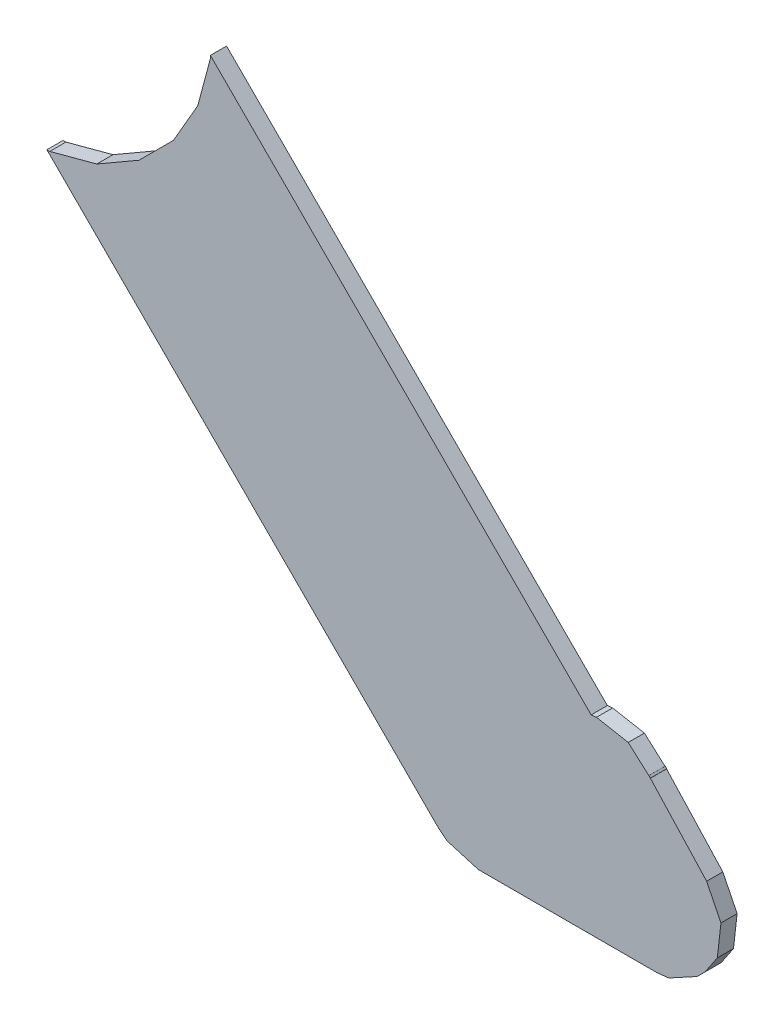
ISO-10303-21;
HEADER;
FILE_DESCRIPTION(('STEP AP214'),'2;1');
FILE_NAME('part.step','',(''),(''),'','','');
FILE_SCHEMA(('AUTOMOTIVE_DESIGN { 1 0 10303 214 1 1 1 1 }'));
ENDSEC;
DATA;
#1=APPLICATION_CONTEXT('core data for automotive mechanical design processes');
#2=APPLICATION_PROTOCOL_DEFINITION('international standard','automotive_design',2000,#1);
#3=PRODUCT_CONTEXT('',#1,'mechanical');
#4=PRODUCT('Part','Part','',(#3));
#5=PRODUCT_RELATED_PRODUCT_CATEGORY('part','',(#4));
#6=PRODUCT_DEFINITION_FORMATION('','',#4);
#7=PRODUCT_DEFINITION_CONTEXT('part definition',#1,'design');
#8=PRODUCT_DEFINITION('design','',#6,#7);
#9=PRODUCT_DEFINITION_SHAPE('','',#8);
#10=(LENGTH_UNIT() NAMED_UNIT(*) SI_UNIT(.MILLI.,.METRE.));
#11=(NAMED_UNIT(*) PLANE_ANGLE_UNIT() SI_UNIT($,.RADIAN.));
#12=(NAMED_UNIT(*) SI_UNIT($,.STERADIAN.) SOLID_ANGLE_UNIT());
#13=UNCERTAINTY_MEASURE_WITH_UNIT(LENGTH_MEASURE(1.E-05),#10,'distance_accuracy_value','');
#14=(GEOMETRIC_REPRESENTATION_CONTEXT(3) GLOBAL_UNCERTAINTY_ASSIGNED_CONTEXT((#13)) GLOBAL_UNIT_ASSIGNED_CONTEXT((#10,
#11,#12)) REPRESENTATION_CONTEXT('',''));
#15=CARTESIAN_POINT('',(0.,0.,0.));
#16=DIRECTION('',(0.,0.,1.));
#17=DIRECTION('',(1.,0.,0.));
#18=AXIS2_PLACEMENT_3D('',#15,#16,#17);
#19=CARTESIAN_POINT('',(0.,0.,0.));
#20=DIRECTION('',(0.,0.,1.));
#21=DIRECTION('',(1.,0.,0.));
#22=AXIS2_PLACEMENT_3D('',#19,#20,#21);
#23=PLANE('',#22);
#24=DIRECTION('',(0.707106781186548,-0.707106781186548,0.));
#25=VECTOR('',#24,1.);
#26=CARTESIAN_POINT('',(141.624,-73.198446,0.));
#27=LINE('',#26,#25);
#28=CARTESIAN_POINT('',(141.624,-73.198446,0.));
#29=VERTEX_POINT('',#28);
#30=CARTESIAN_POINT('',(142.447435,-74.021881,0.));
#31=VERTEX_POINT('',#30);
#32=EDGE_CURVE('E20',#29,#31,#27,.T.);
#33=ORIENTED_EDGE('',*,*,#32,.F.);
#34=DIRECTION('',(0.,1.,0.));
#35=VECTOR('',#34,1.);
#36=CARTESIAN_POINT('',(141.624,-73.204661,0.));
#37=LINE('',#36,#35);
#38=CARTESIAN_POINT('',(141.624,-73.204661,0.));
#39=VERTEX_POINT('',#38);
#40=EDGE_CURVE('E242',#39,#29,#37,.T.);
#41=ORIENTED_EDGE('',*,*,#40,.F.);
#42=DIRECTION('',(0.258816607244931,0.965926479507743,0.));
#43=VECTOR('',#42,1.);
#44=CARTESIAN_POINT('',(141.596741,-73.306394,0.));
#45=LINE('',#44,#43);
#46=CARTESIAN_POINT('',(141.596741,-73.306394,0.));
#47=VERTEX_POINT('',#46);
#48=EDGE_CURVE('E245',#47,#39,#45,.T.);
#49=ORIENTED_EDGE('',*,*,#48,.F.);
#50=DIRECTION('',(0.499998057724796,0.866026525154647,0.));
#51=VECTOR('',#50,1.);
#52=CARTESIAN_POINT('',(141.54408,-73.397606,0.));
#53=LINE('',#52,#51);
#54=CARTESIAN_POINT('',(141.54408,-73.397606,0.));
#55=VERTEX_POINT('',#54);
#56=EDGE_CURVE('E304',#55,#47,#53,.T.);
#57=ORIENTED_EDGE('',*,*,#56,.F.);
#58=DIRECTION('',(0.707106781186548,0.707106781186548,0.));
#59=VECTOR('',#58,1.);
#60=CARTESIAN_POINT('',(141.469606,-73.47208,0.));
#61=LINE('',#60,#59);
#62=CARTESIAN_POINT('',(141.469606,-73.47208,0.));
#63=VERTEX_POINT('',#62);
#64=EDGE_CURVE('E322',#63,#55,#61,.T.);
#65=ORIENTED_EDGE('',*,*,#64,.F.);
#66=DIRECTION('',(0.866026525154647,0.499998057724796,0.));
#67=VECTOR('',#66,1.);
#68=CARTESIAN_POINT('',(141.378394,-73.524741,0.));
#69=LINE('',#68,#67);
#70=CARTESIAN_POINT('',(141.378394,-73.524741,0.));
#71=VERTEX_POINT('',#70);
#72=EDGE_CURVE('E341',#71,#63,#69,.T.);
#73=ORIENTED_EDGE('',*,*,#72,.F.);
#74=DIRECTION('',(0.965926479507743,0.258816607244931,0.));
#75=VECTOR('',#74,1.);
#76=CARTESIAN_POINT('',(141.276661,-73.552,0.));
#77=LINE('',#76,#75);
#78=CARTESIAN_POINT('',(141.276661,-73.552,0.));
#79=VERTEX_POINT('',#78);
#80=EDGE_CURVE('E277',#79,#71,#77,.T.);
#81=ORIENTED_EDGE('',*,*,#80,.F.);
#82=DIRECTION('',(1.,0.,0.));
#83=VECTOR('',#82,1.);
#84=CARTESIAN_POINT('',(141.270446,-73.552,0.));
#85=LINE('',#84,#83);
#86=CARTESIAN_POINT('',(141.270446,-73.552,0.));
#87=VERTEX_POINT('',#86);
#88=EDGE_CURVE('E326',#87,#79,#85,.T.);
#89=ORIENTED_EDGE('',*,*,#88,.F.);
#90=DIRECTION('',(-0.707107199502924,0.707106362869924,0.));
#91=VECTOR('',#90,1.);
#92=CARTESIAN_POINT('',(142.115628,-74.397181,0.));
#93=LINE('',#92,#91);
#94=CARTESIAN_POINT('',(142.115628,-74.397181,0.));
#95=VERTEX_POINT('',#94);
#96=EDGE_CURVE('E309',#95,#87,#93,.T.);
#97=ORIENTED_EDGE('',*,*,#96,.F.);
#98=DIRECTION('',(-0.778648447168256,0.627460433591206,0.));
#99=VECTOR('',#98,1.);
#100=CARTESIAN_POINT('',(142.13627,-74.413815,0.));
#101=LINE('',#100,#99);
#102=CARTESIAN_POINT('',(142.13627,-74.413815,0.));
#103=VERTEX_POINT('',#102);
#104=EDGE_CURVE('E294',#103,#95,#101,.T.);
#105=ORIENTED_EDGE('',*,*,#104,.F.);
#106=DIRECTION('',(-0.959490754592873,0.281740114024963,0.));
#107=VECTOR('',#106,1.);
#108=CARTESIAN_POINT('',(142.203309,-74.4335,0.));
#109=LINE('',#108,#107);
#110=CARTESIAN_POINT('',(142.203309,-74.4335,0.));
#111=VERTEX_POINT('',#110);
#112=EDGE_CURVE('E288',#111,#103,#109,.T.);
#113=ORIENTED_EDGE('',*,*,#112,.F.);
#114=DIRECTION('',(-1.,0.,0.));
#115=VECTOR('',#114,1.);
#116=CARTESIAN_POINT('',(142.588969,-74.4335,0.));
#117=LINE('',#116,#115);
#118=CARTESIAN_POINT('',(142.588969,-74.4335,0.));
#119=VERTEX_POINT('',#118);
#120=EDGE_CURVE('E283',#119,#111,#117,.T.);
#121=ORIENTED_EDGE('',*,*,#120,.F.);
#122=DIRECTION('',(-0.994267127979957,-0.106924638032995,0.));
#123=VECTOR('',#122,1.);
#124=CARTESIAN_POINT('',(142.615331,-74.430665,0.));
#125=LINE('',#124,#123);
#126=CARTESIAN_POINT('',(142.615331,-74.430665,0.));
#127=VERTEX_POINT('',#126);
#128=EDGE_CURVE('E400',#127,#119,#125,.T.);
#129=ORIENTED_EDGE('',*,*,#128,.F.);
#130=DIRECTION('',(-0.877669027841351,-0.479267229808192,0.));
#131=VECTOR('',#130,1.);
#132=CARTESIAN_POINT('',(142.676653,-74.397179,0.));
#133=LINE('',#132,#131);
#134=CARTESIAN_POINT('',(142.676653,-74.397179,0.));
#135=VERTEX_POINT('',#134);
#136=EDGE_CURVE('E514',#135,#127,#133,.T.);
#137=ORIENTED_EDGE('',*,*,#136,.F.);
#138=DIRECTION('',(-0.707085922887417,-0.707127638870417,0.));
#139=VECTOR('',#138,1.);
#140=CARTESIAN_POINT('',(142.693603,-74.380228,0.));
#141=LINE('',#140,#139);
#142=CARTESIAN_POINT('',(142.693603,-74.380228,0.));
#143=VERTEX_POINT('',#142);
#144=EDGE_CURVE('E472',#143,#135,#141,.T.);
#145=ORIENTED_EDGE('',*,*,#144,.F.);
#146=DIRECTION('',(-0.557899251719927,-0.829908684693892,0.));
#147=VECTOR('',#146,1.);
#148=CARTESIAN_POINT('',(142.720211,-74.340647,0.));
#149=LINE('',#148,#147);
#150=CARTESIAN_POINT('',(142.720211,-74.340647,0.));
#151=VERTEX_POINT('',#150);
#152=EDGE_CURVE('E493',#151,#143,#149,.T.);
#153=ORIENTED_EDGE('',*,*,#152,.F.);
#154=DIRECTION('',(-0.112495414351994,-0.99365224387095,0.));
#155=VECTOR('',#154,1.);
#156=CARTESIAN_POINT('',(142.728071,-74.271221,0.));
#157=LINE('',#156,#155);
#158=CARTESIAN_POINT('',(142.728071,-74.271221,0.));
#159=VERTEX_POINT('',#158);
#160=EDGE_CURVE('E440',#159,#151,#157,.T.);
#161=ORIENTED_EDGE('',*,*,#160,.F.);
#162=DIRECTION('',(0.442564663002036,-0.896736594024073,0.));
#163=VECTOR('',#162,1.);
#164=CARTESIAN_POINT('',(142.697149,-74.208566,0.));
#165=LINE('',#164,#163);
#166=CARTESIAN_POINT('',(142.697149,-74.208566,0.));
#167=VERTEX_POINT('',#166);
#168=EDGE_CURVE('E394',#167,#159,#165,.T.);
#169=ORIENTED_EDGE('',*,*,#168,.F.);
#170=DIRECTION('',(0.677282903208041,-0.735722684863045,0.));
#171=VECTOR('',#170,1.);
#172=CARTESIAN_POINT('',(142.575831,-74.07678,0.));
#173=LINE('',#172,#171);
#174=CARTESIAN_POINT('',(142.575831,-74.07678,0.));
#175=VERTEX_POINT('',#174);
#176=EDGE_CURVE('E457',#175,#167,#173,.T.);
#177=ORIENTED_EDGE('',*,*,#176,.F.);
#178=DIRECTION('',(0.5462677805389,-0.837610596843846,0.));
#179=VECTOR('',#178,1.);
#180=CARTESIAN_POINT('',(142.575456,-74.076205,0.));
#181=LINE('',#180,#179);
#182=CARTESIAN_POINT('',(142.575456,-74.076205,0.));
#183=VERTEX_POINT('',#182);
#184=EDGE_CURVE('E445',#183,#175,#181,.T.);
#185=ORIENTED_EDGE('',*,*,#184,.F.);
#186=DIRECTION('',(0.745159422245727,-0.666886373708756,0.));
#187=VECTOR('',#186,1.);
#188=CARTESIAN_POINT('',(142.575218,-74.075992,0.));
#189=LINE('',#188,#187);
#190=CARTESIAN_POINT('',(142.575218,-74.075992,0.));
#191=VERTEX_POINT('',#190);
#192=EDGE_CURVE('E422',#191,#183,#189,.T.);
#193=ORIENTED_EDGE('',*,*,#192,.F.);
#194=DIRECTION('',(0.61420896246173,-0.789143428301653,0.));
#195=VECTOR('',#194,1.);
#196=CARTESIAN_POINT('',(142.572683,-74.072735,0.));
#197=LINE('',#196,#195);
#198=CARTESIAN_POINT('',(142.572683,-74.072735,0.));
#199=VERTEX_POINT('',#198);
#200=EDGE_CURVE('E378',#199,#191,#197,.T.);
#201=ORIENTED_EDGE('',*,*,#200,.F.);
#202=DIRECTION('',(0.789783766543973,0.613385361826979,0.));
#203=VECTOR('',#202,1.);
#204=CARTESIAN_POINT('',(142.572092,-74.073194,0.));
#205=LINE('',#204,#203);
#206=CARTESIAN_POINT('',(142.572092,-74.073194,0.));
#207=VERTEX_POINT('',#206);
#208=EDGE_CURVE('E388',#207,#199,#205,.T.);
#209=ORIENTED_EDGE('',*,*,#208,.F.);
#210=DIRECTION('',(0.745231243913527,-0.666806113570577,0.));
#211=VECTOR('',#210,1.);
#212=CARTESIAN_POINT('',(142.527573,-74.03336,0.));
#213=LINE('',#212,#211);
#214=CARTESIAN_POINT('',(142.527573,-74.03336,0.));
#215=VERTEX_POINT('',#214);
#216=EDGE_CURVE('E363',#215,#207,#213,.T.);
#217=ORIENTED_EDGE('',*,*,#216,.F.);
#218=DIRECTION('',(0.98343956374106,-0.181236377333011,0.));
#219=VECTOR('',#218,1.);
#220=CARTESIAN_POINT('',(142.45886,-74.020697,0.));
#221=LINE('',#220,#219);
#222=CARTESIAN_POINT('',(142.45886,-74.020697,0.));
#223=VERTEX_POINT('',#222);
#224=EDGE_CURVE('E365',#223,#215,#221,.T.);
#225=ORIENTED_EDGE('',*,*,#224,.F.);
#226=DIRECTION('',(0.994673033582067,0.103080338885007,0.));
#227=VECTOR('',#226,1.);
#228=CARTESIAN_POINT('',(142.447435,-74.021881,0.));
#229=LINE('',#228,#227);
#230=EDGE_CURVE('E656',#31,#223,#229,.T.);
#231=ORIENTED_EDGE('',*,*,#230,.F.);
#232=EDGE_LOOP('',(#33,#41,#49,#57,#65,#73,#81,#89,#97,#105,#113,#121,#129,#137,#145,#153,#161,
#169,#177,#185,#193,#201,#209,#217,#225,#231));
#233=FACE_BOUND('',#232,.T.);
#234=ADVANCED_FACE('F17',(#233),#23,.T.);
#235=CARTESIAN_POINT('',(0.,0.,-0.035));
#236=DIRECTION('',(0.,0.,1.));
#237=DIRECTION('',(1.,0.,0.));
#238=AXIS2_PLACEMENT_3D('',#235,#236,#237);
#239=PLANE('',#238);
#240=DIRECTION('',(0.994673033582067,0.103080338885007,0.));
#241=VECTOR('',#240,1.);
#242=CARTESIAN_POINT('',(142.447435,-74.021881,-0.035));
#243=LINE('',#242,#241);
#244=CARTESIAN_POINT('',(142.447435,-74.021881,-0.035));
#245=VERTEX_POINT('',#244);
#246=CARTESIAN_POINT('',(142.45886,-74.020697,-0.035));
#247=VERTEX_POINT('',#246);
#248=EDGE_CURVE('E370',#245,#247,#243,.T.);
#249=ORIENTED_EDGE('',*,*,#248,.T.);
#250=DIRECTION('',(0.98343956374106,-0.181236377333011,0.));
#251=VECTOR('',#250,1.);
#252=CARTESIAN_POINT('',(142.45886,-74.020697,-0.035));
#253=LINE('',#252,#251);
#254=CARTESIAN_POINT('',(142.527573,-74.03336,-0.035));
#255=VERTEX_POINT('',#254);
#256=EDGE_CURVE('E377',#247,#255,#253,.T.);
#257=ORIENTED_EDGE('',*,*,#256,.T.);
#258=DIRECTION('',(0.745231243913527,-0.666806113570577,0.));
#259=VECTOR('',#258,1.);
#260=CARTESIAN_POINT('',(142.527573,-74.03336,-0.035));
#261=LINE('',#260,#259);
#262=CARTESIAN_POINT('',(142.572092,-74.073194,-0.035));
#263=VERTEX_POINT('',#262);
#264=EDGE_CURVE('E384',#255,#263,#261,.T.);
#265=ORIENTED_EDGE('',*,*,#264,.T.);
#266=DIRECTION('',(0.789783766543973,0.613385361826979,0.));
#267=VECTOR('',#266,1.);
#268=CARTESIAN_POINT('',(142.572092,-74.073194,-0.035));
#269=LINE('',#268,#267);
#270=CARTESIAN_POINT('',(142.572683,-74.072735,-0.035));
#271=VERTEX_POINT('',#270);
#272=EDGE_CURVE('E383',#263,#271,#269,.T.);
#273=ORIENTED_EDGE('',*,*,#272,.T.);
#274=DIRECTION('',(0.61420896246173,-0.789143428301653,0.));
#275=VECTOR('',#274,1.);
#276=CARTESIAN_POINT('',(142.572683,-74.072735,-0.035));
#277=LINE('',#276,#275);
#278=CARTESIAN_POINT('',(142.575218,-74.075992,-0.035));
#279=VERTEX_POINT('',#278);
#280=EDGE_CURVE('E418',#271,#279,#277,.T.);
#281=ORIENTED_EDGE('',*,*,#280,.T.);
#282=DIRECTION('',(0.745159422245727,-0.666886373708756,0.));
#283=VECTOR('',#282,1.);
#284=CARTESIAN_POINT('',(142.575218,-74.075992,-0.035));
#285=LINE('',#284,#283);
#286=CARTESIAN_POINT('',(142.575456,-74.076205,-0.035));
#287=VERTEX_POINT('',#286);
#288=EDGE_CURVE('E433',#279,#287,#285,.T.);
#289=ORIENTED_EDGE('',*,*,#288,.T.);
#290=DIRECTION('',(0.5462677805389,-0.837610596843846,0.));
#291=VECTOR('',#290,1.);
#292=CARTESIAN_POINT('',(142.575456,-74.076205,-0.035));
#293=LINE('',#292,#291);
#294=CARTESIAN_POINT('',(142.575831,-74.07678,-0.035));
#295=VERTEX_POINT('',#294);
#296=EDGE_CURVE('E453',#287,#295,#293,.T.);
#297=ORIENTED_EDGE('',*,*,#296,.T.);
#298=DIRECTION('',(0.677282903208041,-0.735722684863045,0.));
#299=VECTOR('',#298,1.);
#300=CARTESIAN_POINT('',(142.575831,-74.07678,-0.035));
#301=LINE('',#300,#299);
#302=CARTESIAN_POINT('',(142.697149,-74.208566,-0.035));
#303=VERTEX_POINT('',#302);
#304=EDGE_CURVE('E390',#295,#303,#301,.T.);
#305=ORIENTED_EDGE('',*,*,#304,.T.);
#306=DIRECTION('',(0.442564663002036,-0.896736594024073,0.));
#307=VECTOR('',#306,1.);
#308=CARTESIAN_POINT('',(142.697149,-74.208566,-0.035));
#309=LINE('',#308,#307);
#310=CARTESIAN_POINT('',(142.728071,-74.271221,-0.035));
#311=VERTEX_POINT('',#310);
#312=EDGE_CURVE('E436',#303,#311,#309,.T.);
#313=ORIENTED_EDGE('',*,*,#312,.T.);
#314=DIRECTION('',(-0.112495414351994,-0.99365224387095,0.));
#315=VECTOR('',#314,1.);
#316=CARTESIAN_POINT('',(142.728071,-74.271221,-0.035));
#317=LINE('',#316,#315);
#318=CARTESIAN_POINT('',(142.720211,-74.340647,-0.035));
#319=VERTEX_POINT('',#318);
#320=EDGE_CURVE('E489',#311,#319,#317,.T.);
#321=ORIENTED_EDGE('',*,*,#320,.T.);
#322=DIRECTION('',(-0.557899251719927,-0.829908684693892,0.));
#323=VECTOR('',#322,1.);
#324=CARTESIAN_POINT('',(142.720211,-74.340647,-0.035));
#325=LINE('',#324,#323);
#326=CARTESIAN_POINT('',(142.693603,-74.380228,-0.035));
#327=VERTEX_POINT('',#326);
#328=EDGE_CURVE('E501',#319,#327,#325,.T.);
#329=ORIENTED_EDGE('',*,*,#328,.T.);
#330=DIRECTION('',(-0.707085922887417,-0.707127638870417,0.));
#331=VECTOR('',#330,1.);
#332=CARTESIAN_POINT('',(142.693603,-74.380228,-0.035));
#333=LINE('',#332,#331);
#334=CARTESIAN_POINT('',(142.676653,-74.397179,-0.035));
#335=VERTEX_POINT('',#334);
#336=EDGE_CURVE('E471',#327,#335,#333,.T.);
#337=ORIENTED_EDGE('',*,*,#336,.T.);
#338=DIRECTION('',(-0.877669027841351,-0.479267229808192,0.));
#339=VECTOR('',#338,1.);
#340=CARTESIAN_POINT('',(142.676653,-74.397179,-0.035));
#341=LINE('',#340,#339);
#342=CARTESIAN_POINT('',(142.615331,-74.430665,-0.035));
#343=VERTEX_POINT('',#342);
#344=EDGE_CURVE('E405',#335,#343,#341,.T.);
#345=ORIENTED_EDGE('',*,*,#344,.T.);
#346=DIRECTION('',(-0.994267127979957,-0.106924638032995,0.));
#347=VECTOR('',#346,1.);
#348=CARTESIAN_POINT('',(142.615331,-74.430665,-0.035));
#349=LINE('',#348,#347);
#350=CARTESIAN_POINT('',(142.588969,-74.4335,-0.035));
#351=VERTEX_POINT('',#350);
#352=EDGE_CURVE('E275',#343,#351,#349,.T.);
#353=ORIENTED_EDGE('',*,*,#352,.T.);
#354=DIRECTION('',(-1.,0.,0.));
#355=VECTOR('',#354,1.);
#356=CARTESIAN_POINT('',(142.588969,-74.4335,-0.035));
#357=LINE('',#356,#355);
#358=CARTESIAN_POINT('',(142.203309,-74.4335,-0.035));
#359=VERTEX_POINT('',#358);
#360=EDGE_CURVE('E293',#351,#359,#357,.T.);
#361=ORIENTED_EDGE('',*,*,#360,.T.);
#362=DIRECTION('',(-0.959490754592873,0.281740114024963,0.));
#363=VECTOR('',#362,1.);
#364=CARTESIAN_POINT('',(142.203309,-74.4335,-0.035));
#365=LINE('',#364,#363);
#366=CARTESIAN_POINT('',(142.13627,-74.413815,-0.035));
#367=VERTEX_POINT('',#366);
#368=EDGE_CURVE('E299',#359,#367,#365,.T.);
#369=ORIENTED_EDGE('',*,*,#368,.T.);
#370=DIRECTION('',(-0.778648447168256,0.627460433591206,0.));
#371=VECTOR('',#370,1.);
#372=CARTESIAN_POINT('',(142.13627,-74.413815,-0.035));
#373=LINE('',#372,#371);
#374=CARTESIAN_POINT('',(142.115628,-74.397181,-0.035));
#375=VERTEX_POINT('',#374);
#376=EDGE_CURVE('E306',#367,#375,#373,.T.);
#377=ORIENTED_EDGE('',*,*,#376,.T.);
#378=DIRECTION('',(-0.707107199502924,0.707106362869924,0.));
#379=VECTOR('',#378,1.);
#380=CARTESIAN_POINT('',(142.115628,-74.397181,-0.035));
#381=LINE('',#380,#379);
#382=CARTESIAN_POINT('',(141.270446,-73.552,-0.035));
#383=VERTEX_POINT('',#382);
#384=EDGE_CURVE('E318',#375,#383,#381,.T.);
#385=ORIENTED_EDGE('',*,*,#384,.T.);
#386=DIRECTION('',(1.,0.,0.));
#387=VECTOR('',#386,1.);
#388=CARTESIAN_POINT('',(141.270446,-73.552,-0.035));
#389=LINE('',#388,#387);
#390=CARTESIAN_POINT('',(141.276661,-73.552,-0.035));
#391=VERTEX_POINT('',#390);
#392=EDGE_CURVE('E282',#383,#391,#389,.T.);
#393=ORIENTED_EDGE('',*,*,#392,.T.);
#394=DIRECTION('',(0.965926479507743,0.258816607244931,0.));
#395=VECTOR('',#394,1.);
#396=CARTESIAN_POINT('',(141.276661,-73.552,-0.035));
#397=LINE('',#396,#395);
#398=CARTESIAN_POINT('',(141.378394,-73.524741,-0.035));
#399=VERTEX_POINT('',#398);
#400=EDGE_CURVE('E337',#391,#399,#397,.T.);
#401=ORIENTED_EDGE('',*,*,#400,.T.);
#402=DIRECTION('',(0.866026525154647,0.499998057724796,0.));
#403=VECTOR('',#402,1.);
#404=CARTESIAN_POINT('',(141.378394,-73.524741,-0.035));
#405=LINE('',#404,#403);
#406=CARTESIAN_POINT('',(141.469606,-73.47208,-0.035));
#407=VERTEX_POINT('',#406);
#408=EDGE_CURVE('E342',#399,#407,#405,.T.);
#409=ORIENTED_EDGE('',*,*,#408,.T.);
#410=DIRECTION('',(0.707106781186548,0.707106781186548,0.));
#411=VECTOR('',#410,1.);
#412=CARTESIAN_POINT('',(141.469606,-73.47208,-0.035));
#413=LINE('',#412,#411);
#414=CARTESIAN_POINT('',(141.54408,-73.397606,-0.035));
#415=VERTEX_POINT('',#414);
#416=EDGE_CURVE('E300',#407,#415,#413,.T.);
#417=ORIENTED_EDGE('',*,*,#416,.T.);
#418=DIRECTION('',(0.499998057724796,0.866026525154647,0.));
#419=VECTOR('',#418,1.);
#420=CARTESIAN_POINT('',(141.54408,-73.397606,-0.035));
#421=LINE('',#420,#419);
#422=CARTESIAN_POINT('',(141.596741,-73.306394,-0.035));
#423=VERTEX_POINT('',#422);
#424=EDGE_CURVE('E265',#415,#423,#421,.T.);
#425=ORIENTED_EDGE('',*,*,#424,.T.);
#426=DIRECTION('',(0.258816607244931,0.965926479507743,0.));
#427=VECTOR('',#426,1.);
#428=CARTESIAN_POINT('',(141.596741,-73.306394,-0.035));
#429=LINE('',#428,#427);
#430=CARTESIAN_POINT('',(141.624,-73.204661,-0.035));
#431=VERTEX_POINT('',#430);
#432=EDGE_CURVE('E251',#423,#431,#429,.T.);
#433=ORIENTED_EDGE('',*,*,#432,.T.);
#434=DIRECTION('',(0.,1.,0.));
#435=VECTOR('',#434,1.);
#436=CARTESIAN_POINT('',(141.624,-73.204661,-0.035));
#437=LINE('',#436,#435);
#438=CARTESIAN_POINT('',(141.624,-73.198446,-0.035));
#439=VERTEX_POINT('',#438);
#440=EDGE_CURVE('E256',#431,#439,#437,.T.);
#441=ORIENTED_EDGE('',*,*,#440,.T.);
#442=DIRECTION('',(0.707106781186548,-0.707106781186548,0.));
#443=VECTOR('',#442,1.);
#444=CARTESIAN_POINT('',(141.624,-73.198446,-0.035));
#445=LINE('',#444,#443);
#446=EDGE_CURVE('E11',#439,#245,#445,.T.);
#447=ORIENTED_EDGE('',*,*,#446,.T.);
#448=EDGE_LOOP('',(#249,#257,#265,#273,#281,#289,#297,#305,#313,#321,#329,#337,#345,#353,#361,
#369,#377,#385,#393,#401,#409,#417,#425,#433,#441,#447));
#449=FACE_BOUND('',#448,.T.);
#450=ADVANCED_FACE('F531',(#449),#239,.F.);
#451=CARTESIAN_POINT('',(141.624,-73.198446,-0.035));
#452=DIRECTION('',(0.707106781186548,0.707106781186548,0.));
#453=DIRECTION('',(0.,0.,-1.));
#454=AXIS2_PLACEMENT_3D('',#451,#452,#453);
#455=PLANE('',#454);
#456=DIRECTION('',(0.,0.,1.));
#457=VECTOR('',#456,1.);
#458=CARTESIAN_POINT('',(141.624,-73.198446,-0.035));
#459=LINE('',#458,#457);
#460=EDGE_CURVE('E250',#439,#29,#459,.T.);
#461=ORIENTED_EDGE('',*,*,#460,.T.);
#462=ORIENTED_EDGE('',*,*,#32,.T.);
#463=DIRECTION('',(0.,0.,1.));
#464=VECTOR('',#463,1.);
#465=CARTESIAN_POINT('',(142.447435,-74.021881,-0.035));
#466=LINE('',#465,#464);
#467=EDGE_CURVE('E674',#245,#31,#466,.T.);
#468=ORIENTED_EDGE('',*,*,#467,.F.);
#469=ORIENTED_EDGE('',*,*,#446,.F.);
#470=EDGE_LOOP('',(#461,#462,#468,#469));
#471=FACE_BOUND('',#470,.T.);
#472=ADVANCED_FACE('F718',(#471),#455,.T.);
#473=CARTESIAN_POINT('',(141.624,-73.204661,-0.035));
#474=DIRECTION('',(-1.,0.,0.));
#475=DIRECTION('',(0.,0.,1.));
#476=AXIS2_PLACEMENT_3D('',#473,#474,#475);
#477=PLANE('',#476);
#478=DIRECTION('',(0.,0.,1.));
#479=VECTOR('',#478,1.);
#480=CARTESIAN_POINT('',(141.624,-73.204661,-0.035));
#481=LINE('',#480,#479);
#482=EDGE_CURVE('E254',#431,#39,#481,.T.);
#483=ORIENTED_EDGE('',*,*,#482,.T.);
#484=ORIENTED_EDGE('',*,*,#40,.T.);
#485=ORIENTED_EDGE('',*,*,#460,.F.);
#486=ORIENTED_EDGE('',*,*,#440,.F.);
#487=EDGE_LOOP('',(#483,#484,#485,#486));
#488=FACE_BOUND('',#487,.T.);
#489=ADVANCED_FACE('F255',(#488),#477,.T.);
#490=CARTESIAN_POINT('',(141.596741,-73.306394,-0.035));
#491=DIRECTION('',(-0.965926479507743,0.258816607244931,0.));
#492=DIRECTION('',(0.,0.,1.));
#493=AXIS2_PLACEMENT_3D('',#490,#491,#492);
#494=PLANE('',#493);
#495=DIRECTION('',(0.,0.,1.));
#496=VECTOR('',#495,1.);
#497=CARTESIAN_POINT('',(141.596741,-73.306394,-0.035));
#498=LINE('',#497,#496);
#499=EDGE_CURVE('E262',#423,#47,#498,.T.);
#500=ORIENTED_EDGE('',*,*,#499,.T.);
#501=ORIENTED_EDGE('',*,*,#48,.T.);
#502=ORIENTED_EDGE('',*,*,#482,.F.);
#503=ORIENTED_EDGE('',*,*,#432,.F.);
#504=EDGE_LOOP('',(#500,#501,#502,#503));
#505=FACE_BOUND('',#504,.T.);
#506=ADVANCED_FACE('F260',(#505),#494,.T.);
#507=CARTESIAN_POINT('',(141.54408,-73.397606,-0.035));
#508=DIRECTION('',(-0.866026525154647,0.499998057724796,0.));
#509=DIRECTION('',(0.,0.,1.));
#510=AXIS2_PLACEMENT_3D('',#507,#508,#509);
#511=PLANE('',#510);
#512=DIRECTION('',(0.,0.,1.));
#513=VECTOR('',#512,1.);
#514=CARTESIAN_POINT('',(141.54408,-73.397606,-0.035));
#515=LINE('',#514,#513);
#516=EDGE_CURVE('E305',#415,#55,#515,.T.);
#517=ORIENTED_EDGE('',*,*,#516,.T.);
#518=ORIENTED_EDGE('',*,*,#56,.T.);
#519=ORIENTED_EDGE('',*,*,#499,.F.);
#520=ORIENTED_EDGE('',*,*,#424,.F.);
#521=EDGE_LOOP('',(#517,#518,#519,#520));
#522=FACE_BOUND('',#521,.T.);
#523=ADVANCED_FACE('F739',(#522),#511,.T.);
#524=CARTESIAN_POINT('',(141.469606,-73.47208,-0.035));
#525=DIRECTION('',(-0.707106781186548,0.707106781186548,0.));
#526=DIRECTION('',(0.,0.,1.));
#527=AXIS2_PLACEMENT_3D('',#524,#525,#526);
#528=PLANE('',#527);
#529=DIRECTION('',(0.,0.,1.));
#530=VECTOR('',#529,1.);
#531=CARTESIAN_POINT('',(141.469606,-73.47208,-0.035));
#532=LINE('',#531,#530);
#533=EDGE_CURVE('E346',#407,#63,#532,.T.);
#534=ORIENTED_EDGE('',*,*,#533,.T.);
#535=ORIENTED_EDGE('',*,*,#64,.T.);
#536=ORIENTED_EDGE('',*,*,#516,.F.);
#537=ORIENTED_EDGE('',*,*,#416,.F.);
#538=EDGE_LOOP('',(#534,#535,#536,#537));
#539=FACE_BOUND('',#538,.T.);
#540=ADVANCED_FACE('F747',(#539),#528,.T.);
#541=CARTESIAN_POINT('',(141.378394,-73.524741,-0.035));
#542=DIRECTION('',(-0.499998057724796,0.866026525154647,0.));
#543=DIRECTION('',(0.,0.,1.));
#544=AXIS2_PLACEMENT_3D('',#541,#542,#543);
#545=PLANE('',#544);
#546=DIRECTION('',(0.,0.,1.));
#547=VECTOR('',#546,1.);
#548=CARTESIAN_POINT('',(141.378394,-73.524741,-0.035));
#549=LINE('',#548,#547);
#550=EDGE_CURVE('E281',#399,#71,#549,.T.);
#551=ORIENTED_EDGE('',*,*,#550,.T.);
#552=ORIENTED_EDGE('',*,*,#72,.T.);
#553=ORIENTED_EDGE('',*,*,#533,.F.);
#554=ORIENTED_EDGE('',*,*,#408,.F.);
#555=EDGE_LOOP('',(#551,#552,#553,#554));
#556=FACE_BOUND('',#555,.T.);
#557=ADVANCED_FACE('F755',(#556),#545,.T.);
#558=CARTESIAN_POINT('',(141.276661,-73.552,-0.035));
#559=DIRECTION('',(-0.258816607244931,0.965926479507743,0.));
#560=DIRECTION('',(0.,0.,1.));
#561=AXIS2_PLACEMENT_3D('',#558,#559,#560);
#562=PLANE('',#561);
#563=DIRECTION('',(0.,0.,1.));
#564=VECTOR('',#563,1.);
#565=CARTESIAN_POINT('',(141.276661,-73.552,-0.035));
#566=LINE('',#565,#564);
#567=EDGE_CURVE('E330',#391,#79,#566,.T.);
#568=ORIENTED_EDGE('',*,*,#567,.T.);
#569=ORIENTED_EDGE('',*,*,#80,.T.);
#570=ORIENTED_EDGE('',*,*,#550,.F.);
#571=ORIENTED_EDGE('',*,*,#400,.F.);
#572=EDGE_LOOP('',(#568,#569,#570,#571));
#573=FACE_BOUND('',#572,.T.);
#574=ADVANCED_FACE('F764',(#573),#562,.T.);
#575=CARTESIAN_POINT('',(141.270446,-73.552,-0.035));
#576=DIRECTION('',(0.,1.,0.));
#577=DIRECTION('',(1.,0.,0.));
#578=AXIS2_PLACEMENT_3D('',#575,#576,#577);
#579=PLANE('',#578);
#580=DIRECTION('',(0.,0.,1.));
#581=VECTOR('',#580,1.);
#582=CARTESIAN_POINT('',(141.270446,-73.552,-0.035));
#583=LINE('',#582,#581);
#584=EDGE_CURVE('E314',#383,#87,#583,.T.);
#585=ORIENTED_EDGE('',*,*,#584,.T.);
#586=ORIENTED_EDGE('',*,*,#88,.T.);
#587=ORIENTED_EDGE('',*,*,#567,.F.);
#588=ORIENTED_EDGE('',*,*,#392,.F.);
#589=EDGE_LOOP('',(#585,#586,#587,#588));
#590=FACE_BOUND('',#589,.T.);
#591=ADVANCED_FACE('F773',(#590),#579,.T.);
#592=CARTESIAN_POINT('',(142.115628,-74.397181,-0.035));
#593=DIRECTION('',(-0.707106362869924,-0.707107199502924,0.));
#594=DIRECTION('',(-0.707107199502924,0.707106362869924,0.));
#595=AXIS2_PLACEMENT_3D('',#592,#593,#594);
#596=PLANE('',#595);
#597=DIRECTION('',(0.,0.,1.));
#598=VECTOR('',#597,1.);
#599=CARTESIAN_POINT('',(142.115628,-74.397181,-0.035));
#600=LINE('',#599,#598);
#601=EDGE_CURVE('E298',#375,#95,#600,.T.);
#602=ORIENTED_EDGE('',*,*,#601,.T.);
#603=ORIENTED_EDGE('',*,*,#96,.T.);
#604=ORIENTED_EDGE('',*,*,#584,.F.);
#605=ORIENTED_EDGE('',*,*,#384,.F.);
#606=EDGE_LOOP('',(#602,#603,#604,#605));
#607=FACE_BOUND('',#606,.T.);
#608=ADVANCED_FACE('F782',(#607),#596,.T.);
#609=CARTESIAN_POINT('',(142.13627,-74.413815,-0.035));
#610=DIRECTION('',(-0.627460433591206,-0.778648447168256,0.));
#611=DIRECTION('',(-0.778648447168256,0.627460433591206,0.));
#612=AXIS2_PLACEMENT_3D('',#609,#610,#611);
#613=PLANE('',#612);
#614=DIRECTION('',(0.,0.,1.));
#615=VECTOR('',#614,1.);
#616=CARTESIAN_POINT('',(142.13627,-74.413815,-0.035));
#617=LINE('',#616,#615);
#618=EDGE_CURVE('E292',#367,#103,#617,.T.);
#619=ORIENTED_EDGE('',*,*,#618,.T.);
#620=ORIENTED_EDGE('',*,*,#104,.T.);
#621=ORIENTED_EDGE('',*,*,#601,.F.);
#622=ORIENTED_EDGE('',*,*,#376,.F.);
#623=EDGE_LOOP('',(#619,#620,#621,#622));
#624=FACE_BOUND('',#623,.T.);
#625=ADVANCED_FACE('F791',(#624),#613,.T.);
#626=CARTESIAN_POINT('',(142.203309,-74.4335,-0.035));
#627=DIRECTION('',(-0.281740114024963,-0.959490754592873,0.));
#628=DIRECTION('',(-0.959490754592873,0.281740114024963,0.));
#629=AXIS2_PLACEMENT_3D('',#626,#627,#628);
#630=PLANE('',#629);
#631=DIRECTION('',(0.,0.,1.));
#632=VECTOR('',#631,1.);
#633=CARTESIAN_POINT('',(142.203309,-74.4335,-0.035));
#634=LINE('',#633,#632);
#635=EDGE_CURVE('E287',#359,#111,#634,.T.);
#636=ORIENTED_EDGE('',*,*,#635,.T.);
#637=ORIENTED_EDGE('',*,*,#112,.T.);
#638=ORIENTED_EDGE('',*,*,#618,.F.);
#639=ORIENTED_EDGE('',*,*,#368,.F.);
#640=EDGE_LOOP('',(#636,#637,#638,#639));
#641=FACE_BOUND('',#640,.T.);
#642=ADVANCED_FACE('F800',(#641),#630,.T.);
#643=CARTESIAN_POINT('',(142.588969,-74.4335,-0.035));
#644=DIRECTION('',(0.,-1.,0.));
#645=DIRECTION('',(0.,0.,-1.));
#646=AXIS2_PLACEMENT_3D('',#643,#644,#645);
#647=PLANE('',#646);
#648=DIRECTION('',(0.,0.,1.));
#649=VECTOR('',#648,1.);
#650=CARTESIAN_POINT('',(142.588969,-74.4335,-0.035));
#651=LINE('',#650,#649);
#652=EDGE_CURVE('E404',#351,#119,#651,.T.);
#653=ORIENTED_EDGE('',*,*,#652,.T.);
#654=ORIENTED_EDGE('',*,*,#120,.T.);
#655=ORIENTED_EDGE('',*,*,#635,.F.);
#656=ORIENTED_EDGE('',*,*,#360,.F.);
#657=EDGE_LOOP('',(#653,#654,#655,#656));
#658=FACE_BOUND('',#657,.T.);
#659=ADVANCED_FACE('F806',(#658),#647,.T.);
#660=CARTESIAN_POINT('',(142.615331,-74.430665,-0.035));
#661=DIRECTION('',(0.106924638032995,-0.994267127979957,0.));
#662=DIRECTION('',(0.,0.,-1.));
#663=AXIS2_PLACEMENT_3D('',#660,#661,#662);
#664=PLANE('',#663);
#665=DIRECTION('',(0.,0.,1.));
#666=VECTOR('',#665,1.);
#667=CARTESIAN_POINT('',(142.615331,-74.430665,-0.035));
#668=LINE('',#667,#666);
#669=EDGE_CURVE('E518',#343,#127,#668,.T.);
#670=ORIENTED_EDGE('',*,*,#669,.T.);
#671=ORIENTED_EDGE('',*,*,#128,.T.);
#672=ORIENTED_EDGE('',*,*,#652,.F.);
#673=ORIENTED_EDGE('',*,*,#352,.F.);
#674=EDGE_LOOP('',(#670,#671,#672,#673));
#675=FACE_BOUND('',#674,.T.);
#676=ADVANCED_FACE('F537',(#675),#664,.T.);
#677=CARTESIAN_POINT('',(142.676653,-74.397179,-0.035));
#678=DIRECTION('',(0.479267229808192,-0.877669027841351,0.));
#679=DIRECTION('',(0.,0.,-1.));
#680=AXIS2_PLACEMENT_3D('',#677,#678,#679);
#681=PLANE('',#680);
#682=DIRECTION('',(0.,0.,1.));
#683=VECTOR('',#682,1.);
#684=CARTESIAN_POINT('',(142.676653,-74.397179,-0.035));
#685=LINE('',#684,#683);
#686=EDGE_CURVE('E467',#335,#135,#685,.T.);
#687=ORIENTED_EDGE('',*,*,#686,.T.);
#688=ORIENTED_EDGE('',*,*,#136,.T.);
#689=ORIENTED_EDGE('',*,*,#669,.F.);
#690=ORIENTED_EDGE('',*,*,#344,.F.);
#691=EDGE_LOOP('',(#687,#688,#689,#690));
#692=FACE_BOUND('',#691,.T.);
#693=ADVANCED_FACE('F535',(#692),#681,.T.);
#694=CARTESIAN_POINT('',(142.693603,-74.380228,-0.035));
#695=DIRECTION('',(0.707127638870417,-0.707085922887417,0.));
#696=DIRECTION('',(0.,0.,-1.));
#697=AXIS2_PLACEMENT_3D('',#694,#695,#696);
#698=PLANE('',#697);
#699=DIRECTION('',(0.,0.,1.));
#700=VECTOR('',#699,1.);
#701=CARTESIAN_POINT('',(142.693603,-74.380228,-0.035));
#702=LINE('',#701,#700);
#703=EDGE_CURVE('E497',#327,#143,#702,.T.);
#704=ORIENTED_EDGE('',*,*,#703,.T.);
#705=ORIENTED_EDGE('',*,*,#144,.T.);
#706=ORIENTED_EDGE('',*,*,#686,.F.);
#707=ORIENTED_EDGE('',*,*,#336,.F.);
#708=EDGE_LOOP('',(#704,#705,#706,#707));
#709=FACE_BOUND('',#708,.T.);
#710=ADVANCED_FACE('F827',(#709),#698,.T.);
#711=CARTESIAN_POINT('',(142.720211,-74.340647,-0.035));
#712=DIRECTION('',(0.829908684693892,-0.557899251719927,0.));
#713=DIRECTION('',(0.,0.,-1.));
#714=AXIS2_PLACEMENT_3D('',#711,#712,#713);
#715=PLANE('',#714);
#716=DIRECTION('',(0.,0.,1.));
#717=VECTOR('',#716,1.);
#718=CARTESIAN_POINT('',(142.720211,-74.340647,-0.035));
#719=LINE('',#718,#717);
#720=EDGE_CURVE('E485',#319,#151,#719,.T.);
#721=ORIENTED_EDGE('',*,*,#720,.T.);
#722=ORIENTED_EDGE('',*,*,#152,.T.);
#723=ORIENTED_EDGE('',*,*,#703,.F.);
#724=ORIENTED_EDGE('',*,*,#328,.F.);
#725=EDGE_LOOP('',(#721,#722,#723,#724));
#726=FACE_BOUND('',#725,.T.);
#727=ADVANCED_FACE('F835',(#726),#715,.T.);
#728=CARTESIAN_POINT('',(142.728071,-74.271221,-0.035));
#729=DIRECTION('',(0.99365224387095,-0.112495414351994,0.));
#730=DIRECTION('',(0.,0.,-1.));
#731=AXIS2_PLACEMENT_3D('',#728,#729,#730);
#732=PLANE('',#731);
#733=DIRECTION('',(0.,0.,1.));
#734=VECTOR('',#733,1.);
#735=CARTESIAN_POINT('',(142.728071,-74.271221,-0.035));
#736=LINE('',#735,#734);
#737=EDGE_CURVE('E441',#311,#159,#736,.T.);
#738=ORIENTED_EDGE('',*,*,#737,.T.);
#739=ORIENTED_EDGE('',*,*,#160,.T.);
#740=ORIENTED_EDGE('',*,*,#720,.F.);
#741=ORIENTED_EDGE('',*,*,#320,.F.);
#742=EDGE_LOOP('',(#738,#739,#740,#741));
#743=FACE_BOUND('',#742,.T.);
#744=ADVANCED_FACE('F860',(#743),#732,.T.);
#745=CARTESIAN_POINT('',(142.697149,-74.208566,-0.035));
#746=DIRECTION('',(0.896736594024073,0.442564663002036,0.));
#747=DIRECTION('',(0.,0.,-1.));
#748=AXIS2_PLACEMENT_3D('',#745,#746,#747);
#749=PLANE('',#748);
#750=DIRECTION('',(0.,0.,1.));
#751=VECTOR('',#750,1.);
#752=CARTESIAN_POINT('',(142.697149,-74.208566,-0.035));
#753=LINE('',#752,#751);
#754=EDGE_CURVE('E395',#303,#167,#753,.T.);
#755=ORIENTED_EDGE('',*,*,#754,.T.);
#756=ORIENTED_EDGE('',*,*,#168,.T.);
#757=ORIENTED_EDGE('',*,*,#737,.F.);
#758=ORIENTED_EDGE('',*,*,#312,.F.);
#759=EDGE_LOOP('',(#755,#756,#757,#758));
#760=FACE_BOUND('',#759,.T.);
#761=ADVANCED_FACE('F847',(#760),#749,.T.);
#762=CARTESIAN_POINT('',(142.575831,-74.07678,-0.035));
#763=DIRECTION('',(0.735722684863045,0.677282903208041,0.));
#764=DIRECTION('',(0.,0.,-1.));
#765=AXIS2_PLACEMENT_3D('',#762,#763,#764);
#766=PLANE('',#765);
#767=DIRECTION('',(0.,0.,1.));
#768=VECTOR('',#767,1.);
#769=CARTESIAN_POINT('',(142.575831,-74.07678,-0.035));
#770=LINE('',#769,#768);
#771=EDGE_CURVE('E449',#295,#175,#770,.T.);
#772=ORIENTED_EDGE('',*,*,#771,.T.);
#773=ORIENTED_EDGE('',*,*,#176,.T.);
#774=ORIENTED_EDGE('',*,*,#754,.F.);
#775=ORIENTED_EDGE('',*,*,#304,.F.);
#776=EDGE_LOOP('',(#772,#773,#774,#775));
#777=FACE_BOUND('',#776,.T.);
#778=ADVANCED_FACE('F841',(#777),#766,.T.);
#779=CARTESIAN_POINT('',(142.575456,-74.076205,-0.035));
#780=DIRECTION('',(0.837610596843846,0.5462677805389,0.));
#781=DIRECTION('',(0.,0.,-1.));
#782=AXIS2_PLACEMENT_3D('',#779,#780,#781);
#783=PLANE('',#782);
#784=DIRECTION('',(0.,0.,1.));
#785=VECTOR('',#784,1.);
#786=CARTESIAN_POINT('',(142.575456,-74.076205,-0.035));
#787=LINE('',#786,#785);
#788=EDGE_CURVE('E429',#287,#183,#787,.T.);
#789=ORIENTED_EDGE('',*,*,#788,.T.);
#790=ORIENTED_EDGE('',*,*,#184,.T.);
#791=ORIENTED_EDGE('',*,*,#771,.F.);
#792=ORIENTED_EDGE('',*,*,#296,.F.);
#793=EDGE_LOOP('',(#789,#790,#791,#792));
#794=FACE_BOUND('',#793,.T.);
#795=ADVANCED_FACE('F846',(#794),#783,.T.);
#796=CARTESIAN_POINT('',(142.575218,-74.075992,-0.035));
#797=DIRECTION('',(0.666886373708756,0.745159422245727,0.));
#798=DIRECTION('',(0.,0.,-1.));
#799=AXIS2_PLACEMENT_3D('',#796,#797,#798);
#800=PLANE('',#799);
#801=DIRECTION('',(0.,0.,1.));
#802=VECTOR('',#801,1.);
#803=CARTESIAN_POINT('',(142.575218,-74.075992,-0.035));
#804=LINE('',#803,#802);
#805=EDGE_CURVE('E382',#279,#191,#804,.T.);
#806=ORIENTED_EDGE('',*,*,#805,.T.);
#807=ORIENTED_EDGE('',*,*,#192,.T.);
#808=ORIENTED_EDGE('',*,*,#788,.F.);
#809=ORIENTED_EDGE('',*,*,#288,.F.);
#810=EDGE_LOOP('',(#806,#807,#808,#809));
#811=FACE_BOUND('',#810,.T.);
#812=ADVANCED_FACE('F872',(#811),#800,.T.);
#813=CARTESIAN_POINT('',(142.572683,-74.072735,-0.035));
#814=DIRECTION('',(0.789143428301653,0.61420896246173,0.));
#815=DIRECTION('',(0.,0.,-1.));
#816=AXIS2_PLACEMENT_3D('',#813,#814,#815);
#817=PLANE('',#816);
#818=DIRECTION('',(0.,0.,1.));
#819=VECTOR('',#818,1.);
#820=CARTESIAN_POINT('',(142.572683,-74.072735,-0.035));
#821=LINE('',#820,#819);
#822=EDGE_CURVE('E399',#271,#199,#821,.T.);
#823=ORIENTED_EDGE('',*,*,#822,.T.);
#824=ORIENTED_EDGE('',*,*,#200,.T.);
#825=ORIENTED_EDGE('',*,*,#805,.F.);
#826=ORIENTED_EDGE('',*,*,#280,.F.);
#827=EDGE_LOOP('',(#823,#824,#825,#826));
#828=FACE_BOUND('',#827,.T.);
#829=ADVANCED_FACE('F705',(#828),#817,.T.);
#830=CARTESIAN_POINT('',(142.572092,-74.073194,-0.035));
#831=DIRECTION('',(-0.613385361826979,0.789783766543973,0.));
#832=DIRECTION('',(0.,0.,1.));
#833=AXIS2_PLACEMENT_3D('',#830,#831,#832);
#834=PLANE('',#833);
#835=DIRECTION('',(0.,0.,1.));
#836=VECTOR('',#835,1.);
#837=CARTESIAN_POINT('',(142.572092,-74.073194,-0.035));
#838=LINE('',#837,#836);
#839=EDGE_CURVE('E389',#263,#207,#838,.T.);
#840=ORIENTED_EDGE('',*,*,#839,.T.);
#841=ORIENTED_EDGE('',*,*,#208,.T.);
#842=ORIENTED_EDGE('',*,*,#822,.F.);
#843=ORIENTED_EDGE('',*,*,#272,.F.);
#844=EDGE_LOOP('',(#840,#841,#842,#843));
#845=FACE_BOUND('',#844,.T.);
#846=ADVANCED_FACE('F698',(#845),#834,.T.);
#847=CARTESIAN_POINT('',(142.527573,-74.03336,-0.035));
#848=DIRECTION('',(0.666806113570577,0.745231243913527,0.));
#849=DIRECTION('',(0.,0.,-1.));
#850=AXIS2_PLACEMENT_3D('',#847,#848,#849);
#851=PLANE('',#850);
#852=DIRECTION('',(0.,0.,1.));
#853=VECTOR('',#852,1.);
#854=CARTESIAN_POINT('',(142.527573,-74.03336,-0.035));
#855=LINE('',#854,#853);
#856=EDGE_CURVE('E369',#255,#215,#855,.T.);
#857=ORIENTED_EDGE('',*,*,#856,.T.);
#858=ORIENTED_EDGE('',*,*,#216,.T.);
#859=ORIENTED_EDGE('',*,*,#839,.F.);
#860=ORIENTED_EDGE('',*,*,#264,.F.);
#861=EDGE_LOOP('',(#857,#858,#859,#860));
#862=FACE_BOUND('',#861,.T.);
#863=ADVANCED_FACE('F701',(#862),#851,.T.);
#864=CARTESIAN_POINT('',(142.45886,-74.020697,-0.035));
#865=DIRECTION('',(0.181236377333011,0.98343956374106,0.));
#866=DIRECTION('',(0.,0.,-1.));
#867=AXIS2_PLACEMENT_3D('',#864,#865,#866);
#868=PLANE('',#867);
#869=DIRECTION('',(0.,0.,1.));
#870=VECTOR('',#869,1.);
#871=CARTESIAN_POINT('',(142.45886,-74.020697,-0.035));
#872=LINE('',#871,#870);
#873=EDGE_CURVE('E649',#247,#223,#872,.T.);
#874=ORIENTED_EDGE('',*,*,#873,.T.);
#875=ORIENTED_EDGE('',*,*,#224,.T.);
#876=ORIENTED_EDGE('',*,*,#856,.F.);
#877=ORIENTED_EDGE('',*,*,#256,.F.);
#878=EDGE_LOOP('',(#874,#875,#876,#877));
#879=FACE_BOUND('',#878,.T.);
#880=ADVANCED_FACE('F910',(#879),#868,.T.);
#881=CARTESIAN_POINT('',(142.447435,-74.021881,-0.035));
#882=DIRECTION('',(-0.103080338885007,0.994673033582067,0.));
#883=DIRECTION('',(0.,0.,1.));
#884=AXIS2_PLACEMENT_3D('',#881,#882,#883);
#885=PLANE('',#884);
#886=ORIENTED_EDGE('',*,*,#467,.T.);
#887=ORIENTED_EDGE('',*,*,#230,.T.);
#888=ORIENTED_EDGE('',*,*,#873,.F.);
#889=ORIENTED_EDGE('',*,*,#248,.F.);
#890=EDGE_LOOP('',(#886,#887,#888,#889));
#891=FACE_BOUND('',#890,.T.);
#892=ADVANCED_FACE('F918',(#891),#885,.T.);
#893=CLOSED_SHELL('',(#234,#450,#472,#489,#506,#523,#540,#557,#574,#591,#608,#625,#642,#659,
#676,#693,#710,#727,#744,#761,#778,#795,#812,#829,#846,#863,#880,#892));
#894=MANIFOLD_SOLID_BREP('B1',#893);
#895=ADVANCED_BREP_SHAPE_REPRESENTATION('',(#18,#894),#14);
#896=SHAPE_DEFINITION_REPRESENTATION(#9,#895);
ENDSEC;
END-ISO-10303-21;
